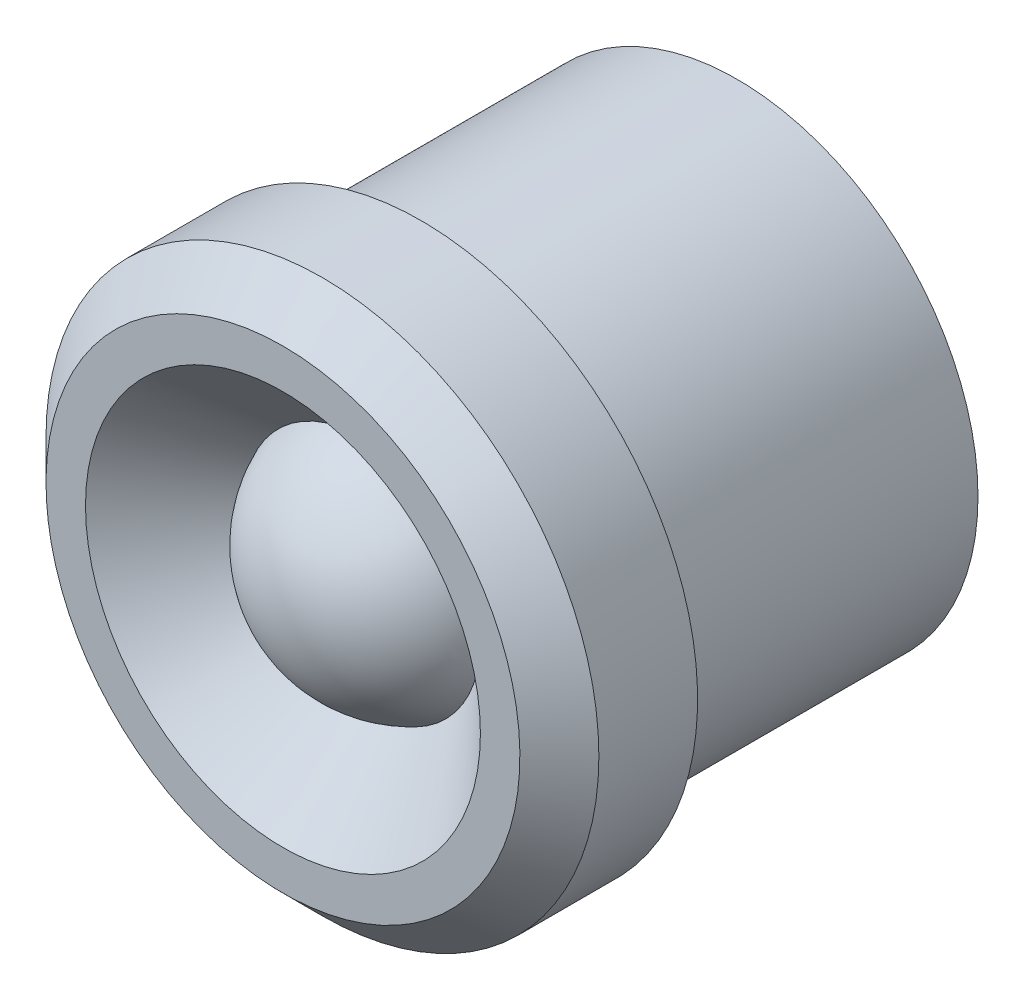
ISO-10303-21;
HEADER;
FILE_DESCRIPTION(('STEP AP214'),'2;1');
FILE_NAME('part.step','',(''),(''),'','','');
FILE_SCHEMA(('AUTOMOTIVE_DESIGN { 1 0 10303 214 1 1 1 1 }'));
ENDSEC;
DATA;
#1=APPLICATION_CONTEXT('core data for automotive mechanical design processes');
#2=APPLICATION_PROTOCOL_DEFINITION('international standard','automotive_design',2000,#1);
#3=PRODUCT_CONTEXT('',#1,'mechanical');
#4=PRODUCT('Part','Part','',(#3));
#5=PRODUCT_RELATED_PRODUCT_CATEGORY('part','',(#4));
#6=PRODUCT_DEFINITION_FORMATION('','',#4);
#7=PRODUCT_DEFINITION_CONTEXT('part definition',#1,'design');
#8=PRODUCT_DEFINITION('design','',#6,#7);
#9=PRODUCT_DEFINITION_SHAPE('','',#8);
#10=(LENGTH_UNIT() NAMED_UNIT(*) SI_UNIT(.MILLI.,.METRE.));
#11=(NAMED_UNIT(*) PLANE_ANGLE_UNIT() SI_UNIT($,.RADIAN.));
#12=(NAMED_UNIT(*) SI_UNIT($,.STERADIAN.) SOLID_ANGLE_UNIT());
#13=UNCERTAINTY_MEASURE_WITH_UNIT(LENGTH_MEASURE(1.E-05),#10,'distance_accuracy_value','');
#14=(GEOMETRIC_REPRESENTATION_CONTEXT(3) GLOBAL_UNCERTAINTY_ASSIGNED_CONTEXT((#13)) GLOBAL_UNIT_ASSIGNED_CONTEXT((#10,
#11,#12)) REPRESENTATION_CONTEXT('',''));
#15=CARTESIAN_POINT('',(0.,0.,0.));
#16=DIRECTION('',(0.,0.,1.));
#17=DIRECTION('',(1.,0.,0.));
#18=AXIS2_PLACEMENT_3D('',#15,#16,#17);
#19=CARTESIAN_POINT('',(0.,0.,0.));
#20=DIRECTION('',(0.,0.,1.));
#21=DIRECTION('',(1.,0.,0.));
#22=AXIS2_PLACEMENT_3D('',#19,#20,#21);
#23=PLANE('',#22);
#24=CARTESIAN_POINT('',(0.,0.,0.));
#25=DIRECTION('',(0.,0.,-1.));
#26=DIRECTION('',(-1.,0.,0.));
#27=AXIS2_PLACEMENT_3D('',#24,#25,#26);
#28=CIRCLE('',#27,3.);
#29=CARTESIAN_POINT('',(-3.,0.,0.));
#30=VERTEX_POINT('',#29);
#31=EDGE_CURVE('E20',#30,#30,#28,.F.);
#32=ORIENTED_EDGE('',*,*,#31,.F.);
#33=EDGE_LOOP('',(#32));
#34=FACE_BOUND('',#33,.T.);
#35=ADVANCED_FACE('F17',(#34),#23,.F.);
#36=CARTESIAN_POINT('',(0.,0.,0.));
#37=DIRECTION('',(0.,0.,-1.));
#38=DIRECTION('',(-1.,0.,0.));
#39=AXIS2_PLACEMENT_3D('',#36,#37,#38);
#40=CYLINDRICAL_SURFACE('',#39,3.);
#41=CARTESIAN_POINT('',(0.,0.,-8.));
#42=DIRECTION('',(0.,0.,-1.));
#43=DIRECTION('',(-1.,0.,0.));
#44=AXIS2_PLACEMENT_3D('',#41,#42,#43);
#45=CIRCLE('',#44,3.);
#46=CARTESIAN_POINT('',(-3.,0.,-8.));
#47=VERTEX_POINT('',#46);
#48=EDGE_CURVE('E57',#47,#47,#45,.F.);
#49=ORIENTED_EDGE('',*,*,#48,.F.);
#50=EDGE_LOOP('',(#49));
#51=FACE_BOUND('',#50,.T.);
#52=ORIENTED_EDGE('',*,*,#31,.T.);
#53=EDGE_LOOP('',(#52));
#54=FACE_BOUND('',#53,.T.);
#55=ADVANCED_FACE('F64',(#51,#54),#40,.F.);
#56=CARTESIAN_POINT('',(0.,0.,-8.));
#57=DIRECTION('',(0.,0.,-1.));
#58=DIRECTION('',(-1.,0.,0.));
#59=AXIS2_PLACEMENT_3D('',#56,#57,#58);
#60=PLANE('',#59);
#61=ORIENTED_EDGE('',*,*,#48,.T.);
#62=EDGE_LOOP('',(#61));
#63=FACE_BOUND('',#62,.T.);
#64=CARTESIAN_POINT('',(0.,0.,-8.));
#65=DIRECTION('',(0.,0.,1.));
#66=DIRECTION('',(1.,0.,0.));
#67=AXIS2_PLACEMENT_3D('',#64,#65,#66);
#68=CIRCLE('',#67,6.1);
#69=CARTESIAN_POINT('',(6.1,0.,-8.));
#70=VERTEX_POINT('',#69);
#71=EDGE_CURVE('E55',#70,#70,#68,.T.);
#72=ORIENTED_EDGE('',*,*,#71,.F.);
#73=EDGE_LOOP('',(#72));
#74=FACE_BOUND('',#73,.T.);
#75=ADVANCED_FACE('F71',(#63,#74),#60,.T.);
#76=CARTESIAN_POINT('',(0.,0.,0.));
#77=DIRECTION('',(0.,0.,1.));
#78=DIRECTION('',(1.,0.,0.));
#79=AXIS2_PLACEMENT_3D('',#76,#77,#78);
#80=CYLINDRICAL_SURFACE('',#79,6.1);
#81=CARTESIAN_POINT('',(0.,0.,0.));
#82=DIRECTION('',(0.,0.,1.));
#83=DIRECTION('',(1.,0.,0.));
#84=AXIS2_PLACEMENT_3D('',#81,#82,#83);
#85=CIRCLE('',#84,6.1);
#86=CARTESIAN_POINT('',(6.1,0.,0.));
#87=VERTEX_POINT('',#86);
#88=EDGE_CURVE('E52',#87,#87,#85,.T.);
#89=ORIENTED_EDGE('',*,*,#88,.F.);
#90=EDGE_LOOP('',(#89));
#91=FACE_BOUND('',#90,.T.);
#92=ORIENTED_EDGE('',*,*,#71,.T.);
#93=EDGE_LOOP('',(#92));
#94=FACE_BOUND('',#93,.T.);
#95=ADVANCED_FACE('F76',(#91,#94),#80,.T.);
#96=CARTESIAN_POINT('',(0.,0.,0.));
#97=DIRECTION('',(0.,0.,1.));
#98=DIRECTION('',(1.,0.,0.));
#99=AXIS2_PLACEMENT_3D('',#96,#97,#98);
#100=PLANE('',#99);
#101=ORIENTED_EDGE('',*,*,#88,.T.);
#102=EDGE_LOOP('',(#101));
#103=FACE_BOUND('',#102,.T.);
#104=CARTESIAN_POINT('',(0.,0.,0.));
#105=DIRECTION('',(0.,0.,-1.));
#106=DIRECTION('',(-1.,0.,0.));
#107=AXIS2_PLACEMENT_3D('',#104,#105,#106);
#108=CIRCLE('',#107,7.);
#109=CARTESIAN_POINT('',(-7.,0.,0.));
#110=VERTEX_POINT('',#109);
#111=EDGE_CURVE('E49',#110,#110,#108,.F.);
#112=ORIENTED_EDGE('',*,*,#111,.F.);
#113=EDGE_LOOP('',(#112));
#114=FACE_BOUND('',#113,.T.);
#115=ADVANCED_FACE('F81',(#103,#114),#100,.F.);
#116=CARTESIAN_POINT('',(0.,0.,0.));
#117=DIRECTION('',(0.,0.,-1.));
#118=DIRECTION('',(-1.,0.,0.));
#119=AXIS2_PLACEMENT_3D('',#116,#117,#118);
#120=CYLINDRICAL_SURFACE('',#119,7.);
#121=ORIENTED_EDGE('',*,*,#111,.T.);
#122=EDGE_LOOP('',(#121));
#123=FACE_BOUND('',#122,.T.);
#124=CARTESIAN_POINT('',(0.,0.,2.49999999999995));
#125=DIRECTION('',(0.,0.,-1.));
#126=DIRECTION('',(-1.,0.,0.));
#127=AXIS2_PLACEMENT_3D('',#124,#125,#126);
#128=CIRCLE('',#127,7.);
#129=CARTESIAN_POINT('',(-7.,0.,2.5));
#130=VERTEX_POINT('',#129);
#131=EDGE_CURVE('E45',#130,#130,#128,.F.);
#132=ORIENTED_EDGE('',*,*,#131,.F.);
#133=EDGE_LOOP('',(#132));
#134=FACE_BOUND('',#133,.T.);
#135=ADVANCED_FACE('F85',(#123,#134),#120,.T.);
#136=CARTESIAN_POINT('',(0.,0.,2.5));
#137=DIRECTION('',(0.,0.,-1.));
#138=DIRECTION('',(0.,1.,0.));
#139=AXIS2_PLACEMENT_3D('',#136,#137,#138);
#140=CONICAL_SURFACE('',#139,7.,0.785398163397448);
#141=ORIENTED_EDGE('',*,*,#131,.T.);
#142=EDGE_LOOP('',(#141));
#143=FACE_BOUND('',#142,.T.);
#144=CARTESIAN_POINT('',(0.,0.,3.50000000000006));
#145=DIRECTION('',(0.,0.,-1.));
#146=DIRECTION('',(0.,1.,0.));
#147=AXIS2_PLACEMENT_3D('',#144,#145,#146);
#148=CIRCLE('',#147,5.99999999999994);
#149=CARTESIAN_POINT('',(0.,5.99999999999994,3.50000000000006));
#150=VERTEX_POINT('',#149);
#151=EDGE_CURVE('E42',#150,#150,#148,.F.);
#152=ORIENTED_EDGE('',*,*,#151,.F.);
#153=EDGE_LOOP('',(#152));
#154=FACE_BOUND('',#153,.T.);
#155=ADVANCED_FACE('F89',(#143,#154),#140,.T.);
#156=CARTESIAN_POINT('',(0.,0.,3.5));
#157=DIRECTION('',(0.,0.,1.));
#158=DIRECTION('',(1.,0.,0.));
#159=AXIS2_PLACEMENT_3D('',#156,#157,#158);
#160=PLANE('',#159);
#161=CARTESIAN_POINT('',(0.,0.,3.49999999999995));
#162=DIRECTION('',(0.,0.,1.));
#163=DIRECTION('',(1.,0.,0.));
#164=AXIS2_PLACEMENT_3D('',#161,#162,#163);
#165=CIRCLE('',#164,4.99999999999995);
#166=CARTESIAN_POINT('',(4.99999999999995,0.,3.49999999999995));
#167=VERTEX_POINT('',#166);
#168=EDGE_CURVE('E24',#167,#167,#165,.T.);
#169=ORIENTED_EDGE('',*,*,#168,.F.);
#170=EDGE_LOOP('',(#169));
#171=FACE_BOUND('',#170,.T.);
#172=ORIENTED_EDGE('',*,*,#151,.T.);
#173=EDGE_LOOP('',(#172));
#174=FACE_BOUND('',#173,.T.);
#175=ADVANCED_FACE('F37',(#171,#174),#160,.T.);
#176=CARTESIAN_POINT('',(0.,0.,1.5));
#177=DIRECTION('',(0.,0.,1.));
#178=DIRECTION('',(1.,0.,0.));
#179=AXIS2_PLACEMENT_3D('',#176,#177,#178);
#180=CONICAL_SURFACE('',#179,3.,0.785398163397448);
#181=CARTESIAN_POINT('',(0.,0.,1.5));
#182=DIRECTION('',(0.,0.,1.));
#183=DIRECTION('',(1.,0.,0.));
#184=AXIS2_PLACEMENT_3D('',#181,#182,#183);
#185=CIRCLE('',#184,3.);
#186=CARTESIAN_POINT('',(3.,0.,1.5));
#187=VERTEX_POINT('',#186);
#188=EDGE_CURVE('E11',#187,#187,#185,.T.);
#189=ORIENTED_EDGE('',*,*,#188,.F.);
#190=EDGE_LOOP('',(#189));
#191=FACE_BOUND('',#190,.T.);
#192=ORIENTED_EDGE('',*,*,#168,.T.);
#193=EDGE_LOOP('',(#192));
#194=FACE_BOUND('',#193,.T.);
#195=ADVANCED_FACE('F31',(#191,#194),#180,.F.);
#196=CARTESIAN_POINT('',(0.,0.,3.5));
#197=CARTESIAN_POINT('',(6.50000000000004,0.,3.49999999999991));
#198=CARTESIAN_POINT('',(6.49999999999995,0.,-3.00000000000009));
#199=CARTESIAN_POINT('',(0.,0.,-3.));
#200=(BOUNDED_CURVE() B_SPLINE_CURVE(3,(#196,#197,#198,#199),.UNSPECIFIED.,.F.,
.F.) B_SPLINE_CURVE_WITH_KNOTS((4,4),(0.,1.),
.UNSPECIFIED.) CURVE() GEOMETRIC_REPRESENTATION_ITEM() RATIONAL_B_SPLINE_CURVE((1.,
0.333333333333334,0.333333333333334,1.)) REPRESENTATION_ITEM(''));
#201=CARTESIAN_POINT('',(0.,0.,0.25));
#202=DIRECTION('',(0.,0.,1.));
#203=AXIS1_PLACEMENT('',#201,#202);
#204=SURFACE_OF_REVOLUTION('',#200,#203);
#205=CARTESIAN_POINT('',(0.,0.,3.5));
#206=VERTEX_POINT('',#205);
#207=VERTEX_LOOP('',#206);
#208=FACE_BOUND('',#207,.T.);
#209=ORIENTED_EDGE('',*,*,#188,.T.);
#210=EDGE_LOOP('',(#209));
#211=FACE_BOUND('',#210,.T.);
#212=ADVANCED_FACE('F28',(#208,#211),#204,.F.);
#213=CLOSED_SHELL('',(#35,#55,#75,#95,#115,#135,#155,#175,#195,#212));
#214=MANIFOLD_SOLID_BREP('B1',#213);
#215=ADVANCED_BREP_SHAPE_REPRESENTATION('',(#18,#214),#14);
#216=SHAPE_DEFINITION_REPRESENTATION(#9,#215);
ENDSEC;
END-ISO-10303-21;
